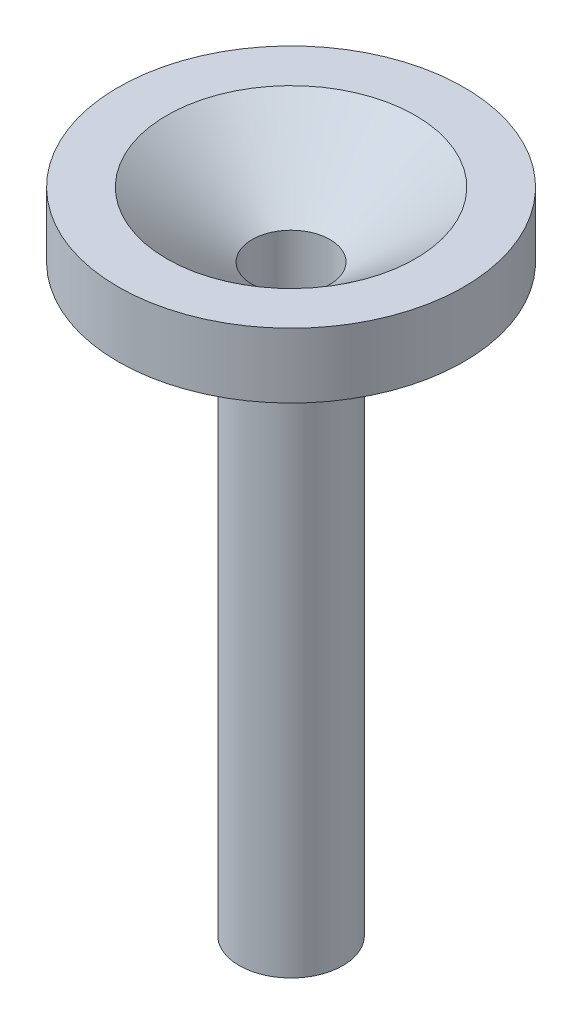
ISO-10303-21;
HEADER;
FILE_DESCRIPTION(('STEP AP214'),'2;1');
FILE_NAME('part.step','',(''),(''),'','','');
FILE_SCHEMA(('AUTOMOTIVE_DESIGN { 1 0 10303 214 1 1 1 1 }'));
ENDSEC;
DATA;
#1=APPLICATION_CONTEXT('core data for automotive mechanical design processes');
#2=APPLICATION_PROTOCOL_DEFINITION('international standard','automotive_design',2000,#1);
#3=PRODUCT_CONTEXT('',#1,'mechanical');
#4=PRODUCT('Part','Part','',(#3));
#5=PRODUCT_RELATED_PRODUCT_CATEGORY('part','',(#4));
#6=PRODUCT_DEFINITION_FORMATION('','',#4);
#7=PRODUCT_DEFINITION_CONTEXT('part definition',#1,'design');
#8=PRODUCT_DEFINITION('design','',#6,#7);
#9=PRODUCT_DEFINITION_SHAPE('','',#8);
#10=(LENGTH_UNIT() NAMED_UNIT(*) SI_UNIT(.MILLI.,.METRE.));
#11=(NAMED_UNIT(*) PLANE_ANGLE_UNIT() SI_UNIT($,.RADIAN.));
#12=(NAMED_UNIT(*) SI_UNIT($,.STERADIAN.) SOLID_ANGLE_UNIT());
#13=UNCERTAINTY_MEASURE_WITH_UNIT(LENGTH_MEASURE(1.E-05),#10,'distance_accuracy_value','');
#14=(GEOMETRIC_REPRESENTATION_CONTEXT(3) GLOBAL_UNCERTAINTY_ASSIGNED_CONTEXT((#13)) GLOBAL_UNIT_ASSIGNED_CONTEXT((#10,
#11,#12)) REPRESENTATION_CONTEXT('',''));
#15=CARTESIAN_POINT('',(0.,0.,0.));
#16=DIRECTION('',(0.,0.,1.));
#17=DIRECTION('',(1.,0.,0.));
#18=AXIS2_PLACEMENT_3D('',#15,#16,#17);
#19=CARTESIAN_POINT('',(10.5,-113.730769230769,0.));
#20=DIRECTION('',(0.,1.,0.));
#21=DIRECTION('',(0.,0.,1.));
#22=AXIS2_PLACEMENT_3D('',#19,#20,#21);
#23=PLANE('',#22);
#24=CARTESIAN_POINT('',(0.,-113.730769230769,0.));
#25=DIRECTION('',(0.,1.,0.));
#26=DIRECTION('',(0.,0.,1.));
#27=AXIS2_PLACEMENT_3D('',#24,#25,#26);
#28=CIRCLE('',#27,10.5);
#29=CARTESIAN_POINT('',(0.,-113.730769230769,10.5));
#30=VERTEX_POINT('',#29);
#31=EDGE_CURVE('E76',#30,#30,#28,.T.);
#32=ORIENTED_EDGE('',*,*,#31,.F.);
#33=EDGE_LOOP('',(#32));
#34=FACE_BOUND('',#33,.T.);
#35=CARTESIAN_POINT('',(0.,-113.730769230769,0.));
#36=DIRECTION('',(0.,1.,0.));
#37=DIRECTION('',(0.,0.,1.));
#38=AXIS2_PLACEMENT_3D('',#35,#36,#37);
#39=CIRCLE('',#38,9.);
#40=CARTESIAN_POINT('',(0.,-113.730769230769,9.));
#41=VERTEX_POINT('',#40);
#42=EDGE_CURVE('E10',#41,#41,#39,.T.);
#43=ORIENTED_EDGE('',*,*,#42,.T.);
#44=EDGE_LOOP('',(#43));
#45=FACE_BOUND('',#44,.T.);
#46=ADVANCED_FACE('F37',(#34,#45),#23,.F.);
#47=CARTESIAN_POINT('',(0.,35.0813054914882,0.));
#48=DIRECTION('',(0.,1.,0.));
#49=DIRECTION('',(0.,0.,1.));
#50=AXIS2_PLACEMENT_3D('',#47,#48,#49);
#51=CYLINDRICAL_SURFACE('',#50,9.);
#52=ORIENTED_EDGE('',*,*,#42,.F.);
#53=EDGE_LOOP('',(#52));
#54=FACE_BOUND('',#53,.T.);
#55=CARTESIAN_POINT('',(0.,16.2692307692308,0.));
#56=DIRECTION('',(0.,1.,0.));
#57=DIRECTION('',(0.,0.,1.));
#58=AXIS2_PLACEMENT_3D('',#55,#56,#57);
#59=CIRCLE('',#58,9.);
#60=CARTESIAN_POINT('',(0.,16.2692307692308,9.));
#61=VERTEX_POINT('',#60);
#62=EDGE_CURVE('E44',#61,#61,#59,.T.);
#63=ORIENTED_EDGE('',*,*,#62,.T.);
#64=EDGE_LOOP('',(#63));
#65=FACE_BOUND('',#64,.T.);
#66=ADVANCED_FACE('F84',(#54,#65),#51,.F.);
#67=CARTESIAN_POINT('',(0.,31.2692307692308,0.));
#68=DIRECTION('',(0.,1.,0.));
#69=DIRECTION('',(0.,0.,1.));
#70=AXIS2_PLACEMENT_3D('',#67,#68,#69);
#71=CONICAL_SURFACE('',#70,28.75,0.92124690465924);
#72=ORIENTED_EDGE('',*,*,#62,.F.);
#73=EDGE_LOOP('',(#72));
#74=FACE_BOUND('',#73,.T.);
#75=CARTESIAN_POINT('',(0.,31.2692307692308,0.));
#76=DIRECTION('',(0.,1.,0.));
#77=DIRECTION('',(0.,0.,1.));
#78=AXIS2_PLACEMENT_3D('',#75,#76,#77);
#79=CIRCLE('',#78,28.75);
#80=CARTESIAN_POINT('',(0.,31.2692307692308,28.75));
#81=VERTEX_POINT('',#80);
#82=EDGE_CURVE('E49',#81,#81,#79,.T.);
#83=ORIENTED_EDGE('',*,*,#82,.T.);
#84=EDGE_LOOP('',(#83));
#85=FACE_BOUND('',#84,.T.);
#86=ADVANCED_FACE('F88',(#74,#85),#71,.F.);
#87=CARTESIAN_POINT('',(28.75,31.2692307692308,0.));
#88=DIRECTION('',(0.,-1.,0.));
#89=DIRECTION('',(0.,0.,-1.));
#90=AXIS2_PLACEMENT_3D('',#87,#88,#89);
#91=PLANE('',#90);
#92=ORIENTED_EDGE('',*,*,#82,.F.);
#93=EDGE_LOOP('',(#92));
#94=FACE_BOUND('',#93,.T.);
#95=CARTESIAN_POINT('',(0.,31.2692307692308,0.));
#96=DIRECTION('',(0.,1.,0.));
#97=DIRECTION('',(0.,0.,1.));
#98=AXIS2_PLACEMENT_3D('',#95,#96,#97);
#99=CIRCLE('',#98,40.);
#100=CARTESIAN_POINT('',(0.,31.2692307692308,40.));
#101=VERTEX_POINT('',#100);
#102=EDGE_CURVE('E54',#101,#101,#99,.T.);
#103=ORIENTED_EDGE('',*,*,#102,.T.);
#104=EDGE_LOOP('',(#103));
#105=FACE_BOUND('',#104,.T.);
#106=ADVANCED_FACE('F93',(#94,#105),#91,.F.);
#107=CARTESIAN_POINT('',(0.,35.0813054914882,0.));
#108=DIRECTION('',(0.,1.,0.));
#109=DIRECTION('',(0.,0.,1.));
#110=AXIS2_PLACEMENT_3D('',#107,#108,#109);
#111=CYLINDRICAL_SURFACE('',#110,40.);
#112=ORIENTED_EDGE('',*,*,#102,.F.);
#113=EDGE_LOOP('',(#112));
#114=FACE_BOUND('',#113,.T.);
#115=CARTESIAN_POINT('',(0.,16.2692307692308,0.));
#116=DIRECTION('',(0.,1.,0.));
#117=DIRECTION('',(0.,0.,1.));
#118=AXIS2_PLACEMENT_3D('',#115,#116,#117);
#119=CIRCLE('',#118,40.);
#120=CARTESIAN_POINT('',(0.,16.2692307692308,40.));
#121=VERTEX_POINT('',#120);
#122=EDGE_CURVE('E60',#121,#121,#119,.T.);
#123=ORIENTED_EDGE('',*,*,#122,.T.);
#124=EDGE_LOOP('',(#123));
#125=FACE_BOUND('',#124,.T.);
#126=ADVANCED_FACE('F99',(#114,#125),#111,.T.);
#127=CARTESIAN_POINT('',(40.,16.2692307692308,0.));
#128=DIRECTION('',(0.,1.,0.));
#129=DIRECTION('',(0.,0.,1.));
#130=AXIS2_PLACEMENT_3D('',#127,#128,#129);
#131=PLANE('',#130);
#132=ORIENTED_EDGE('',*,*,#122,.F.);
#133=EDGE_LOOP('',(#132));
#134=FACE_BOUND('',#133,.T.);
#135=CARTESIAN_POINT('',(0.,16.2692307692308,0.));
#136=DIRECTION('',(0.,1.,0.));
#137=DIRECTION('',(0.,0.,1.));
#138=AXIS2_PLACEMENT_3D('',#135,#136,#137);
#139=CIRCLE('',#138,12.);
#140=CARTESIAN_POINT('',(0.,16.2692307692308,12.));
#141=VERTEX_POINT('',#140);
#142=EDGE_CURVE('E64',#141,#141,#139,.T.);
#143=ORIENTED_EDGE('',*,*,#142,.T.);
#144=EDGE_LOOP('',(#143));
#145=FACE_BOUND('',#144,.T.);
#146=ADVANCED_FACE('F103',(#134,#145),#131,.F.);
#147=CARTESIAN_POINT('',(0.,35.0813054914882,0.));
#148=DIRECTION('',(0.,1.,0.));
#149=DIRECTION('',(0.,0.,1.));
#150=AXIS2_PLACEMENT_3D('',#147,#148,#149);
#151=CYLINDRICAL_SURFACE('',#150,12.);
#152=ORIENTED_EDGE('',*,*,#142,.F.);
#153=EDGE_LOOP('',(#152));
#154=FACE_BOUND('',#153,.T.);
#155=CARTESIAN_POINT('',(0.,-118.730769230769,0.));
#156=DIRECTION('',(0.,1.,0.));
#157=DIRECTION('',(0.,0.,1.));
#158=AXIS2_PLACEMENT_3D('',#155,#156,#157);
#159=CIRCLE('',#158,12.);
#160=CARTESIAN_POINT('',(0.,-118.730769230769,12.));
#161=VERTEX_POINT('',#160);
#162=EDGE_CURVE('E68',#161,#161,#159,.T.);
#163=ORIENTED_EDGE('',*,*,#162,.T.);
#164=EDGE_LOOP('',(#163));
#165=FACE_BOUND('',#164,.T.);
#166=ADVANCED_FACE('F107',(#154,#165),#151,.T.);
#167=CARTESIAN_POINT('',(12.,-118.730769230769,0.));
#168=DIRECTION('',(0.,1.,0.));
#169=DIRECTION('',(0.,0.,1.));
#170=AXIS2_PLACEMENT_3D('',#167,#168,#169);
#171=PLANE('',#170);
#172=ORIENTED_EDGE('',*,*,#162,.F.);
#173=EDGE_LOOP('',(#172));
#174=FACE_BOUND('',#173,.T.);
#175=CARTESIAN_POINT('',(0.,-118.730769230769,0.));
#176=DIRECTION('',(0.,1.,0.));
#177=DIRECTION('',(0.,0.,1.));
#178=AXIS2_PLACEMENT_3D('',#175,#176,#177);
#179=CIRCLE('',#178,10.5);
#180=CARTESIAN_POINT('',(0.,-118.730769230769,10.5));
#181=VERTEX_POINT('',#180);
#182=EDGE_CURVE('E72',#181,#181,#179,.T.);
#183=ORIENTED_EDGE('',*,*,#182,.T.);
#184=EDGE_LOOP('',(#183));
#185=FACE_BOUND('',#184,.T.);
#186=ADVANCED_FACE('F111',(#174,#185),#171,.F.);
#187=CARTESIAN_POINT('',(0.,35.0813054914882,0.));
#188=DIRECTION('',(0.,1.,0.));
#189=DIRECTION('',(0.,0.,1.));
#190=AXIS2_PLACEMENT_3D('',#187,#188,#189);
#191=CYLINDRICAL_SURFACE('',#190,10.5);
#192=ORIENTED_EDGE('',*,*,#182,.F.);
#193=EDGE_LOOP('',(#192));
#194=FACE_BOUND('',#193,.T.);
#195=ORIENTED_EDGE('',*,*,#31,.T.);
#196=EDGE_LOOP('',(#195));
#197=FACE_BOUND('',#196,.T.);
#198=ADVANCED_FACE('F81',(#194,#197),#191,.F.);
#199=CLOSED_SHELL('',(#46,#66,#86,#106,#126,#146,#166,#186,#198));
#200=MANIFOLD_SOLID_BREP('B2',#199);
#201=ADVANCED_BREP_SHAPE_REPRESENTATION('',(#18,#200),#14);
#202=SHAPE_DEFINITION_REPRESENTATION(#9,#201);
ENDSEC;
END-ISO-10303-21;
